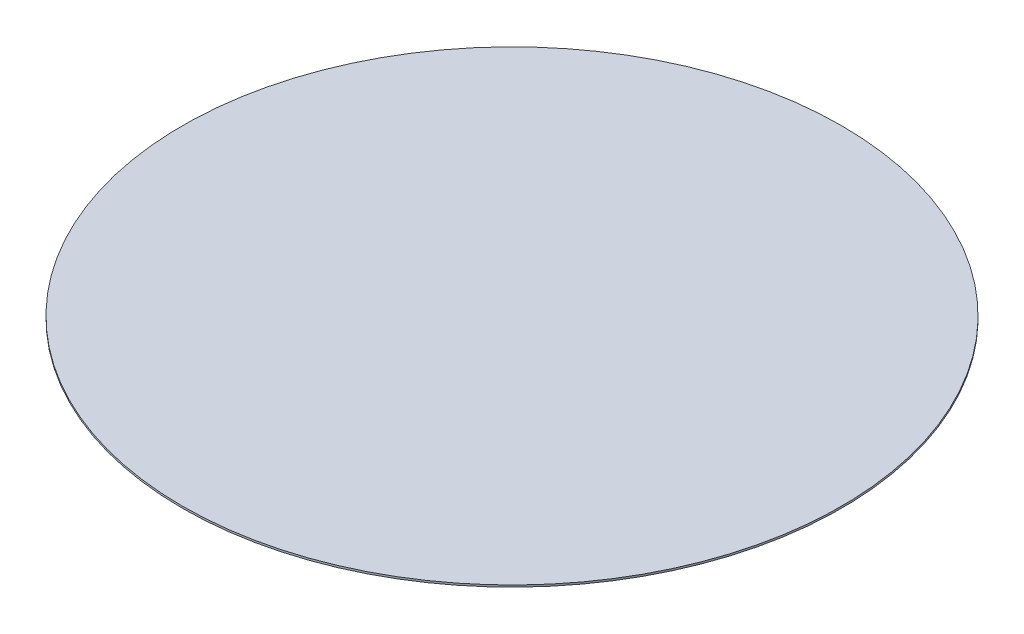
ISO-10303-21;
HEADER;
FILE_DESCRIPTION(('STEP AP214'),'2;1');
FILE_NAME('part.step','',(''),(''),'','','');
FILE_SCHEMA(('AUTOMOTIVE_DESIGN { 1 0 10303 214 1 1 1 1 }'));
ENDSEC;
DATA;
#1=APPLICATION_CONTEXT('core data for automotive mechanical design processes');
#2=APPLICATION_PROTOCOL_DEFINITION('international standard','automotive_design',2000,#1);
#3=PRODUCT_CONTEXT('',#1,'mechanical');
#4=PRODUCT('Part','Part','',(#3));
#5=PRODUCT_RELATED_PRODUCT_CATEGORY('part','',(#4));
#6=PRODUCT_DEFINITION_FORMATION('','',#4);
#7=PRODUCT_DEFINITION_CONTEXT('part definition',#1,'design');
#8=PRODUCT_DEFINITION('design','',#6,#7);
#9=PRODUCT_DEFINITION_SHAPE('','',#8);
#10=(LENGTH_UNIT() NAMED_UNIT(*) SI_UNIT(.MILLI.,.METRE.));
#11=(NAMED_UNIT(*) PLANE_ANGLE_UNIT() SI_UNIT($,.RADIAN.));
#12=(NAMED_UNIT(*) SI_UNIT($,.STERADIAN.) SOLID_ANGLE_UNIT());
#13=UNCERTAINTY_MEASURE_WITH_UNIT(LENGTH_MEASURE(1.E-05),#10,'distance_accuracy_value','');
#14=(GEOMETRIC_REPRESENTATION_CONTEXT(3) GLOBAL_UNCERTAINTY_ASSIGNED_CONTEXT((#13)) GLOBAL_UNIT_ASSIGNED_CONTEXT((#10,
#11,#12)) REPRESENTATION_CONTEXT('',''));
#15=CARTESIAN_POINT('',(0.,0.,0.));
#16=DIRECTION('',(0.,0.,1.));
#17=DIRECTION('',(1.,0.,0.));
#18=AXIS2_PLACEMENT_3D('',#15,#16,#17);
#19=CARTESIAN_POINT('',(0.,1.,0.));
#20=DIRECTION('',(0.,-1.,0.));
#21=DIRECTION('',(0.,0.,-1.));
#22=AXIS2_PLACEMENT_3D('',#19,#20,#21);
#23=CYLINDRICAL_SURFACE('',#22,175.);
#24=CARTESIAN_POINT('',(0.,1.,0.));
#25=DIRECTION('',(0.,1.,0.));
#26=DIRECTION('',(0.,0.,1.));
#27=AXIS2_PLACEMENT_3D('',#24,#25,#26);
#28=CIRCLE('',#27,175.);
#29=CARTESIAN_POINT('',(0.,1.,175.));
#30=VERTEX_POINT('',#29);
#31=EDGE_CURVE('E10',#30,#30,#28,.T.);
#32=ORIENTED_EDGE('',*,*,#31,.F.);
#33=EDGE_LOOP('',(#32));
#34=FACE_BOUND('',#33,.T.);
#35=CARTESIAN_POINT('',(0.,0.,0.));
#36=DIRECTION('',(0.,1.,0.));
#37=DIRECTION('',(0.,0.,1.));
#38=AXIS2_PLACEMENT_3D('',#35,#36,#37);
#39=CIRCLE('',#38,175.);
#40=CARTESIAN_POINT('',(0.,0.,175.));
#41=VERTEX_POINT('',#40);
#42=EDGE_CURVE('E34',#41,#41,#39,.T.);
#43=ORIENTED_EDGE('',*,*,#42,.T.);
#44=EDGE_LOOP('',(#43));
#45=FACE_BOUND('',#44,.T.);
#46=ADVANCED_FACE('F31',(#34,#45),#23,.T.);
#47=CARTESIAN_POINT('',(0.,1.,0.));
#48=DIRECTION('',(0.,1.,0.));
#49=DIRECTION('',(0.,0.,1.));
#50=AXIS2_PLACEMENT_3D('',#47,#48,#49);
#51=PLANE('',#50);
#52=ORIENTED_EDGE('',*,*,#31,.T.);
#53=EDGE_LOOP('',(#52));
#54=FACE_BOUND('',#53,.T.);
#55=ADVANCED_FACE('F46',(#54),#51,.T.);
#56=CARTESIAN_POINT('',(0.,0.,0.));
#57=DIRECTION('',(0.,1.,0.));
#58=DIRECTION('',(0.,0.,1.));
#59=AXIS2_PLACEMENT_3D('',#56,#57,#58);
#60=PLANE('',#59);
#61=ORIENTED_EDGE('',*,*,#42,.F.);
#62=EDGE_LOOP('',(#61));
#63=FACE_BOUND('',#62,.T.);
#64=ADVANCED_FACE('F44',(#63),#60,.F.);
#65=CLOSED_SHELL('',(#46,#55,#64));
#66=MANIFOLD_SOLID_BREP('B2',#65);
#67=ADVANCED_BREP_SHAPE_REPRESENTATION('',(#18,#66),#14);
#68=SHAPE_DEFINITION_REPRESENTATION(#9,#67);
ENDSEC;
END-ISO-10303-21;
